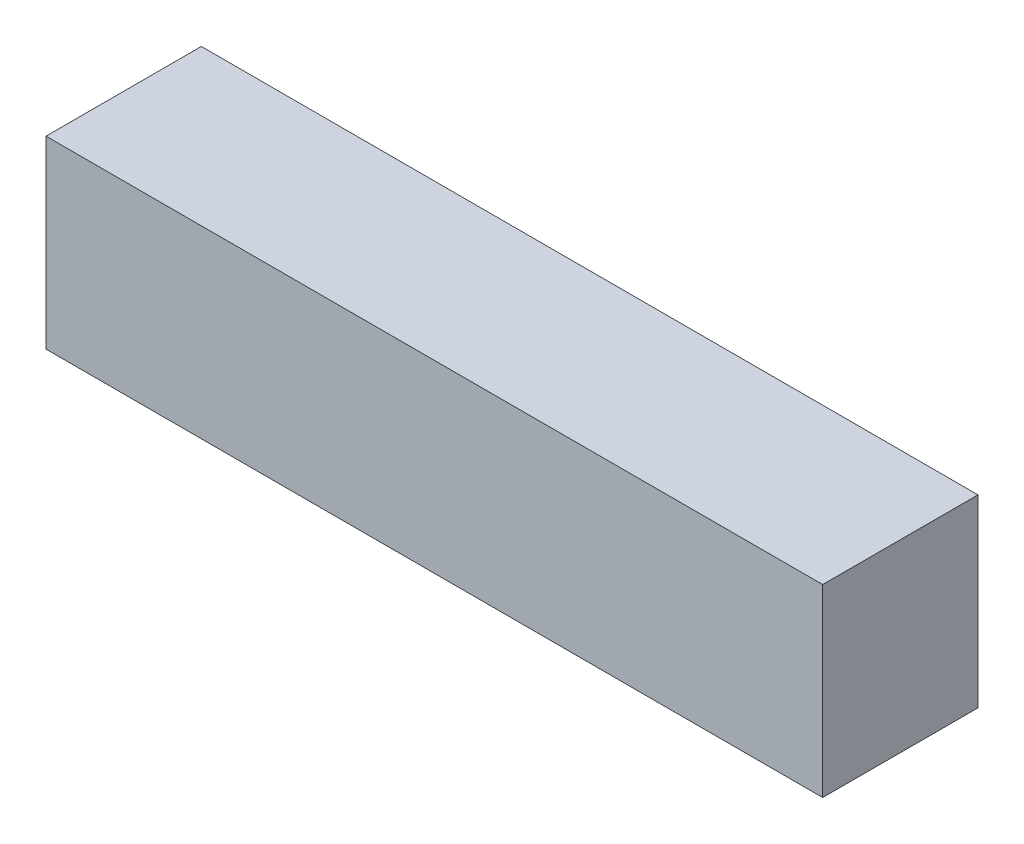
ISO-10303-21;
HEADER;
FILE_DESCRIPTION(('STEP AP214'),'2;1');
FILE_NAME('part.step','',(''),(''),'','','');
FILE_SCHEMA(('AUTOMOTIVE_DESIGN { 1 0 10303 214 1 1 1 1 }'));
ENDSEC;
DATA;
#1=APPLICATION_CONTEXT('core data for automotive mechanical design processes');
#2=APPLICATION_PROTOCOL_DEFINITION('international standard','automotive_design',2000,#1);
#3=PRODUCT_CONTEXT('',#1,'mechanical');
#4=PRODUCT('Part','Part','',(#3));
#5=PRODUCT_RELATED_PRODUCT_CATEGORY('part','',(#4));
#6=PRODUCT_DEFINITION_FORMATION('','',#4);
#7=PRODUCT_DEFINITION_CONTEXT('part definition',#1,'design');
#8=PRODUCT_DEFINITION('design','',#6,#7);
#9=PRODUCT_DEFINITION_SHAPE('','',#8);
#10=(LENGTH_UNIT() NAMED_UNIT(*) SI_UNIT(.MILLI.,.METRE.));
#11=(NAMED_UNIT(*) PLANE_ANGLE_UNIT() SI_UNIT($,.RADIAN.));
#12=(NAMED_UNIT(*) SI_UNIT($,.STERADIAN.) SOLID_ANGLE_UNIT());
#13=UNCERTAINTY_MEASURE_WITH_UNIT(LENGTH_MEASURE(1.E-05),#10,'distance_accuracy_value','');
#14=(GEOMETRIC_REPRESENTATION_CONTEXT(3) GLOBAL_UNCERTAINTY_ASSIGNED_CONTEXT((#13)) GLOBAL_UNIT_ASSIGNED_CONTEXT((#10,
#11,#12)) REPRESENTATION_CONTEXT('',''));
#15=CARTESIAN_POINT('',(0.,0.,0.));
#16=DIRECTION('',(0.,0.,1.));
#17=DIRECTION('',(1.,0.,0.));
#18=AXIS2_PLACEMENT_3D('',#15,#16,#17);
#19=CARTESIAN_POINT('',(0.,2895.6,0.));
#20=DIRECTION('',(1.,0.,0.));
#21=DIRECTION('',(0.,0.,-1.));
#22=AXIS2_PLACEMENT_3D('',#19,#20,#21);
#23=PLANE('',#22);
#24=DIRECTION('',(0.,0.,1.));
#25=VECTOR('',#24,1.);
#26=CARTESIAN_POINT('',(0.,0.,0.));
#27=LINE('',#26,#25);
#28=CARTESIAN_POINT('',(0.,0.,0.));
#29=VERTEX_POINT('',#28);
#30=CARTESIAN_POINT('',(2.98617875504091E-13,0.,2438.4));
#31=VERTEX_POINT('',#30);
#32=EDGE_CURVE('E164',#29,#31,#27,.T.);
#33=ORIENTED_EDGE('',*,*,#32,.T.);
#34=DIRECTION('',(0.,-1.,0.));
#35=VECTOR('',#34,1.);
#36=CARTESIAN_POINT('',(2.98617875504091E-13,2895.6,2438.4));
#37=LINE('',#36,#35);
#38=CARTESIAN_POINT('',(2.98617875504091E-13,2895.6,2438.4));
#39=VERTEX_POINT('',#38);
#40=EDGE_CURVE('E11',#39,#31,#37,.T.);
#41=ORIENTED_EDGE('',*,*,#40,.F.);
#42=DIRECTION('',(0.,0.,1.));
#43=VECTOR('',#42,1.);
#44=CARTESIAN_POINT('',(0.,2895.6,0.));
#45=LINE('',#44,#43);
#46=CARTESIAN_POINT('',(0.,2895.6,0.));
#47=VERTEX_POINT('',#46);
#48=EDGE_CURVE('E170',#47,#39,#45,.T.);
#49=ORIENTED_EDGE('',*,*,#48,.F.);
#50=DIRECTION('',(0.,-1.,0.));
#51=VECTOR('',#50,1.);
#52=CARTESIAN_POINT('',(0.,2895.6,0.));
#53=LINE('',#52,#51);
#54=EDGE_CURVE('E180',#47,#29,#53,.T.);
#55=ORIENTED_EDGE('',*,*,#54,.T.);
#56=EDGE_LOOP('',(#33,#41,#49,#55));
#57=FACE_BOUND('',#56,.T.);
#58=ADVANCED_FACE('F40',(#57),#23,.F.);
#59=CARTESIAN_POINT('',(2.98617875504091E-13,2895.6,2438.4));
#60=DIRECTION('',(0.,0.,-1.));
#61=DIRECTION('',(-1.,0.,0.));
#62=AXIS2_PLACEMENT_3D('',#59,#60,#61);
#63=PLANE('',#62);
#64=DIRECTION('',(1.,0.,0.));
#65=VECTOR('',#64,1.);
#66=CARTESIAN_POINT('',(2.98617875504091E-13,0.,2438.4));
#67=LINE('',#66,#65);
#68=CARTESIAN_POINT('',(12192.,0.,2438.4));
#69=VERTEX_POINT('',#68);
#70=EDGE_CURVE('E184',#31,#69,#67,.T.);
#71=ORIENTED_EDGE('',*,*,#70,.T.);
#72=DIRECTION('',(0.,-1.,0.));
#73=VECTOR('',#72,1.);
#74=CARTESIAN_POINT('',(12192.,2895.6,2438.4));
#75=LINE('',#74,#73);
#76=CARTESIAN_POINT('',(12192.,2895.6,2438.4));
#77=VERTEX_POINT('',#76);
#78=EDGE_CURVE('E49',#77,#69,#75,.T.);
#79=ORIENTED_EDGE('',*,*,#78,.F.);
#80=DIRECTION('',(1.,0.,0.));
#81=VECTOR('',#80,1.);
#82=CARTESIAN_POINT('',(2.98617875504091E-13,2895.6,2438.4));
#83=LINE('',#82,#81);
#84=EDGE_CURVE('E88',#39,#77,#83,.T.);
#85=ORIENTED_EDGE('',*,*,#84,.F.);
#86=ORIENTED_EDGE('',*,*,#40,.T.);
#87=EDGE_LOOP('',(#71,#79,#85,#86));
#88=FACE_BOUND('',#87,.T.);
#89=ADVANCED_FACE('F213',(#88),#63,.F.);
#90=CARTESIAN_POINT('',(12192.,2895.6,0.));
#91=DIRECTION('',(-1.,0.,0.));
#92=DIRECTION('',(0.,0.,1.));
#93=AXIS2_PLACEMENT_3D('',#90,#91,#92);
#94=PLANE('',#93);
#95=DIRECTION('',(0.,0.,-1.));
#96=VECTOR('',#95,1.);
#97=CARTESIAN_POINT('',(12192.,0.,0.));
#98=LINE('',#97,#96);
#99=CARTESIAN_POINT('',(12192.,0.,0.));
#100=VERTEX_POINT('',#99);
#101=EDGE_CURVE('E75',#69,#100,#98,.T.);
#102=ORIENTED_EDGE('',*,*,#101,.T.);
#103=DIRECTION('',(0.,-1.,0.));
#104=VECTOR('',#103,1.);
#105=CARTESIAN_POINT('',(12192.,2895.6,0.));
#106=LINE('',#105,#104);
#107=CARTESIAN_POINT('',(12192.,2895.6,0.));
#108=VERTEX_POINT('',#107);
#109=EDGE_CURVE('E193',#108,#100,#106,.T.);
#110=ORIENTED_EDGE('',*,*,#109,.F.);
#111=DIRECTION('',(0.,0.,-1.));
#112=VECTOR('',#111,1.);
#113=CARTESIAN_POINT('',(12192.,2895.6,0.));
#114=LINE('',#113,#112);
#115=EDGE_CURVE('E175',#77,#108,#114,.T.);
#116=ORIENTED_EDGE('',*,*,#115,.F.);
#117=ORIENTED_EDGE('',*,*,#78,.T.);
#118=EDGE_LOOP('',(#102,#110,#116,#117));
#119=FACE_BOUND('',#118,.T.);
#120=ADVANCED_FACE('F197',(#119),#94,.F.);
#121=CARTESIAN_POINT('',(0.,2895.6,0.));
#122=DIRECTION('',(0.,0.,1.));
#123=DIRECTION('',(1.,0.,0.));
#124=AXIS2_PLACEMENT_3D('',#121,#122,#123);
#125=PLANE('',#124);
#126=DIRECTION('',(-1.,0.,0.));
#127=VECTOR('',#126,1.);
#128=CARTESIAN_POINT('',(0.,0.,0.));
#129=LINE('',#128,#127);
#130=EDGE_CURVE('E81',#100,#29,#129,.T.);
#131=ORIENTED_EDGE('',*,*,#130,.T.);
#132=ORIENTED_EDGE('',*,*,#54,.F.);
#133=DIRECTION('',(-1.,0.,0.));
#134=VECTOR('',#133,1.);
#135=CARTESIAN_POINT('',(0.,2895.6,0.));
#136=LINE('',#135,#134);
#137=EDGE_CURVE('E57',#108,#47,#136,.T.);
#138=ORIENTED_EDGE('',*,*,#137,.F.);
#139=ORIENTED_EDGE('',*,*,#109,.T.);
#140=EDGE_LOOP('',(#131,#132,#138,#139));
#141=FACE_BOUND('',#140,.T.);
#142=ADVANCED_FACE('F204',(#141),#125,.F.);
#143=CARTESIAN_POINT('',(0.,2895.6,0.));
#144=DIRECTION('',(0.,1.,0.));
#145=DIRECTION('',(0.,0.,1.));
#146=AXIS2_PLACEMENT_3D('',#143,#144,#145);
#147=PLANE('',#146);
#148=ORIENTED_EDGE('',*,*,#48,.T.);
#149=ORIENTED_EDGE('',*,*,#84,.T.);
#150=ORIENTED_EDGE('',*,*,#115,.T.);
#151=ORIENTED_EDGE('',*,*,#137,.T.);
#152=EDGE_LOOP('',(#148,#149,#150,#151));
#153=FACE_BOUND('',#152,.T.);
#154=ADVANCED_FACE('F206',(#153),#147,.T.);
#155=CARTESIAN_POINT('',(0.,0.,0.));
#156=DIRECTION('',(0.,1.,0.));
#157=DIRECTION('',(0.,0.,1.));
#158=AXIS2_PLACEMENT_3D('',#155,#156,#157);
#159=PLANE('',#158);
#160=ORIENTED_EDGE('',*,*,#32,.F.);
#161=ORIENTED_EDGE('',*,*,#130,.F.);
#162=ORIENTED_EDGE('',*,*,#101,.F.);
#163=ORIENTED_EDGE('',*,*,#70,.F.);
#164=EDGE_LOOP('',(#160,#161,#162,#163));
#165=FACE_BOUND('',#164,.T.);
#166=ADVANCED_FACE('F200',(#165),#159,.F.);
#167=CLOSED_SHELL('',(#58,#89,#120,#142,#154,#166));
#168=CARTESIAN_POINT('',(12115.8,2743.2,50.7999999999985));
#169=DIRECTION('',(0.,0.,-1.));
#170=DIRECTION('',(0.,1.,0.));
#171=AXIS2_PLACEMENT_3D('',#168,#169,#170);
#172=PLANE('',#171);
#173=DIRECTION('',(0.,-1.,0.));
#174=VECTOR('',#173,1.);
#175=CARTESIAN_POINT('',(76.2,2743.2,50.8));
#176=LINE('',#175,#174);
#177=CARTESIAN_POINT('',(76.2,2743.2,50.8));
#178=VERTEX_POINT('',#177);
#179=CARTESIAN_POINT('',(76.2,152.4,50.8000000000003));
#180=VERTEX_POINT('',#179);
#181=EDGE_CURVE('E122',#178,#180,#176,.T.);
#182=ORIENTED_EDGE('',*,*,#181,.T.);
#183=DIRECTION('',(-1.,0.,0.));
#184=VECTOR('',#183,1.);
#185=CARTESIAN_POINT('',(12115.8,152.4,50.7999999999988));
#186=LINE('',#185,#184);
#187=CARTESIAN_POINT('',(12115.8,152.4,50.7999999999988));
#188=VERTEX_POINT('',#187);
#189=EDGE_CURVE('E115',#188,#180,#186,.T.);
#190=ORIENTED_EDGE('',*,*,#189,.F.);
#191=DIRECTION('',(0.,-1.,0.));
#192=VECTOR('',#191,1.);
#193=CARTESIAN_POINT('',(12115.8,2743.2,50.7999999999985));
#194=LINE('',#193,#192);
#195=CARTESIAN_POINT('',(12115.8,2743.2,50.7999999999985));
#196=VERTEX_POINT('',#195);
#197=EDGE_CURVE('E119',#196,#188,#194,.T.);
#198=ORIENTED_EDGE('',*,*,#197,.F.);
#199=DIRECTION('',(-1.,0.,0.));
#200=VECTOR('',#199,1.);
#201=CARTESIAN_POINT('',(12115.8,2743.2,50.7999999999985));
#202=LINE('',#201,#200);
#203=EDGE_CURVE('E161',#196,#178,#202,.T.);
#204=ORIENTED_EDGE('',*,*,#203,.T.);
#205=EDGE_LOOP('',(#182,#190,#198,#204));
#206=FACE_BOUND('',#205,.T.);
#207=ADVANCED_FACE('F117',(#206),#172,.F.);
#208=CARTESIAN_POINT('',(12115.8,2743.2,50.7999999999985));
#209=DIRECTION('',(0.,1.,0.));
#210=DIRECTION('',(0.,0.,1.));
#211=AXIS2_PLACEMENT_3D('',#208,#209,#210);
#212=PLANE('',#211);
#213=DIRECTION('',(0.,0.,-1.));
#214=VECTOR('',#213,1.);
#215=CARTESIAN_POINT('',(76.2,2743.2,50.8));
#216=LINE('',#215,#214);
#217=CARTESIAN_POINT('',(76.2000000000003,2743.2,2387.6));
#218=VERTEX_POINT('',#217);
#219=EDGE_CURVE('E142',#218,#178,#216,.T.);
#220=ORIENTED_EDGE('',*,*,#219,.T.);
#221=ORIENTED_EDGE('',*,*,#203,.F.);
#222=DIRECTION('',(0.,0.,-1.));
#223=VECTOR('',#222,1.);
#224=CARTESIAN_POINT('',(12115.8,2743.2,50.7999999999985));
#225=LINE('',#224,#223);
#226=CARTESIAN_POINT('',(12115.8,2743.2,2387.6));
#227=VERTEX_POINT('',#226);
#228=EDGE_CURVE('E128',#227,#196,#225,.T.);
#229=ORIENTED_EDGE('',*,*,#228,.F.);
#230=DIRECTION('',(-1.,0.,0.));
#231=VECTOR('',#230,1.);
#232=CARTESIAN_POINT('',(12115.8,2743.2,2387.6));
#233=LINE('',#232,#231);
#234=EDGE_CURVE('E165',#227,#218,#233,.T.);
#235=ORIENTED_EDGE('',*,*,#234,.T.);
#236=EDGE_LOOP('',(#220,#221,#229,#235));
#237=FACE_BOUND('',#236,.T.);
#238=ADVANCED_FACE('F252',(#237),#212,.F.);
#239=CARTESIAN_POINT('',(12115.8,2743.2,2387.6));
#240=DIRECTION('',(0.,0.,1.));
#241=DIRECTION('',(0.,-1.,0.));
#242=AXIS2_PLACEMENT_3D('',#239,#240,#241);
#243=PLANE('',#242);
#244=DIRECTION('',(0.,1.,0.));
#245=VECTOR('',#244,1.);
#246=CARTESIAN_POINT('',(76.2000000000003,2743.2,2387.6));
#247=LINE('',#246,#245);
#248=CARTESIAN_POINT('',(76.2000000000003,152.4,2387.6));
#249=VERTEX_POINT('',#248);
#250=EDGE_CURVE('E146',#249,#218,#247,.T.);
#251=ORIENTED_EDGE('',*,*,#250,.T.);
#252=ORIENTED_EDGE('',*,*,#234,.F.);
#253=DIRECTION('',(0.,1.,0.));
#254=VECTOR('',#253,1.);
#255=CARTESIAN_POINT('',(12115.8,2743.2,2387.6));
#256=LINE('',#255,#254);
#257=CARTESIAN_POINT('',(12115.8,152.4,2387.6));
#258=VERTEX_POINT('',#257);
#259=EDGE_CURVE('E137',#258,#227,#256,.T.);
#260=ORIENTED_EDGE('',*,*,#259,.F.);
#261=DIRECTION('',(-1.,0.,0.));
#262=VECTOR('',#261,1.);
#263=CARTESIAN_POINT('',(12115.8,152.4,2387.6));
#264=LINE('',#263,#262);
#265=EDGE_CURVE('E127',#258,#249,#264,.T.);
#266=ORIENTED_EDGE('',*,*,#265,.T.);
#267=EDGE_LOOP('',(#251,#252,#260,#266));
#268=FACE_BOUND('',#267,.T.);
#269=ADVANCED_FACE('F262',(#268),#243,.F.);
#270=CARTESIAN_POINT('',(12115.8,152.4,50.7999999999988));
#271=DIRECTION('',(0.,-1.,0.));
#272=DIRECTION('',(0.,0.,-1.));
#273=AXIS2_PLACEMENT_3D('',#270,#271,#272);
#274=PLANE('',#273);
#275=DIRECTION('',(0.,0.,1.));
#276=VECTOR('',#275,1.);
#277=CARTESIAN_POINT('',(76.2,152.4,50.8000000000003));
#278=LINE('',#277,#276);
#279=EDGE_CURVE('E155',#180,#249,#278,.T.);
#280=ORIENTED_EDGE('',*,*,#279,.T.);
#281=ORIENTED_EDGE('',*,*,#265,.F.);
#282=DIRECTION('',(0.,0.,1.));
#283=VECTOR('',#282,1.);
#284=CARTESIAN_POINT('',(12115.8,152.4,50.7999999999988));
#285=LINE('',#284,#283);
#286=EDGE_CURVE('E131',#188,#258,#285,.T.);
#287=ORIENTED_EDGE('',*,*,#286,.F.);
#288=ORIENTED_EDGE('',*,*,#189,.T.);
#289=EDGE_LOOP('',(#280,#281,#287,#288));
#290=FACE_BOUND('',#289,.T.);
#291=ADVANCED_FACE('F132',(#290),#274,.F.);
#292=CARTESIAN_POINT('',(12115.8,0.,-1.48392902803941E-12));
#293=DIRECTION('',(-1.,0.,0.));
#294=DIRECTION('',(0.,0.,1.));
#295=AXIS2_PLACEMENT_3D('',#292,#293,#294);
#296=PLANE('',#295);
#297=ORIENTED_EDGE('',*,*,#197,.T.);
#298=ORIENTED_EDGE('',*,*,#286,.T.);
#299=ORIENTED_EDGE('',*,*,#259,.T.);
#300=ORIENTED_EDGE('',*,*,#228,.T.);
#301=EDGE_LOOP('',(#297,#298,#299,#300));
#302=FACE_BOUND('',#301,.T.);
#303=ADVANCED_FACE('F139',(#302),#296,.T.);
#304=CARTESIAN_POINT('',(76.2,0.,0.));
#305=DIRECTION('',(-1.,0.,0.));
#306=DIRECTION('',(0.,0.,1.));
#307=AXIS2_PLACEMENT_3D('',#304,#305,#306);
#308=PLANE('',#307);
#309=ORIENTED_EDGE('',*,*,#181,.F.);
#310=ORIENTED_EDGE('',*,*,#219,.F.);
#311=ORIENTED_EDGE('',*,*,#250,.F.);
#312=ORIENTED_EDGE('',*,*,#279,.F.);
#313=EDGE_LOOP('',(#309,#310,#311,#312));
#314=FACE_BOUND('',#313,.T.);
#315=ADVANCED_FACE('F289',(#314),#308,.F.);
#316=CLOSED_SHELL('',(#207,#238,#269,#291,#303,#315));
#317=ORIENTED_CLOSED_SHELL('',*,#316,.T.);
#318=BREP_WITH_VOIDS('B2',#167,(#317));
#319=ADVANCED_BREP_SHAPE_REPRESENTATION('',(#18,#318),#14);
#320=SHAPE_DEFINITION_REPRESENTATION(#9,#319);
ENDSEC;
END-ISO-10303-21;
